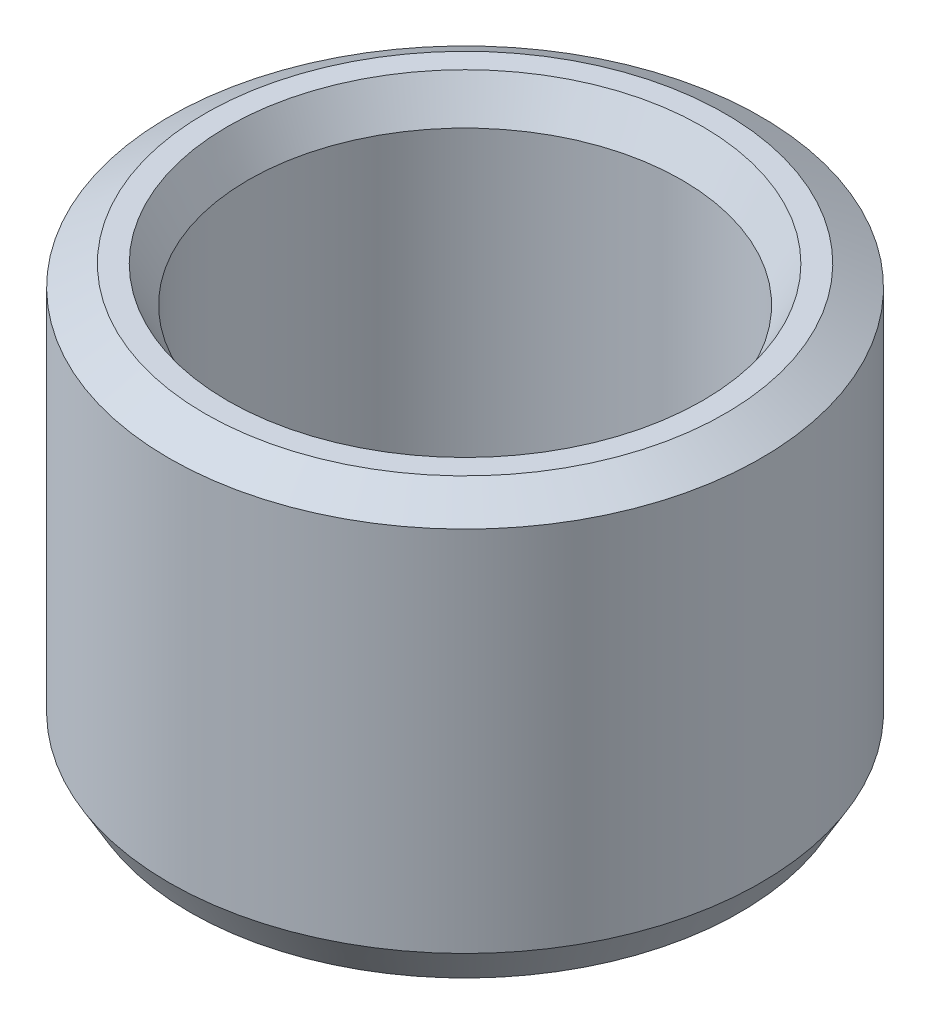
ISO-10303-21;
HEADER;
FILE_DESCRIPTION(('STEP AP214'),'2;1');
FILE_NAME('part.step','',(''),(''),'','','');
FILE_SCHEMA(('AUTOMOTIVE_DESIGN { 1 0 10303 214 1 1 1 1 }'));
ENDSEC;
DATA;
#1=APPLICATION_CONTEXT('core data for automotive mechanical design processes');
#2=APPLICATION_PROTOCOL_DEFINITION('international standard','automotive_design',2000,#1);
#3=PRODUCT_CONTEXT('',#1,'mechanical');
#4=PRODUCT('Part','Part','',(#3));
#5=PRODUCT_RELATED_PRODUCT_CATEGORY('part','',(#4));
#6=PRODUCT_DEFINITION_FORMATION('','',#4);
#7=PRODUCT_DEFINITION_CONTEXT('part definition',#1,'design');
#8=PRODUCT_DEFINITION('design','',#6,#7);
#9=PRODUCT_DEFINITION_SHAPE('','',#8);
#10=(LENGTH_UNIT() NAMED_UNIT(*) SI_UNIT(.MILLI.,.METRE.));
#11=(NAMED_UNIT(*) PLANE_ANGLE_UNIT() SI_UNIT($,.RADIAN.));
#12=(NAMED_UNIT(*) SI_UNIT($,.STERADIAN.) SOLID_ANGLE_UNIT());
#13=UNCERTAINTY_MEASURE_WITH_UNIT(LENGTH_MEASURE(1.E-05),#10,'distance_accuracy_value','');
#14=(GEOMETRIC_REPRESENTATION_CONTEXT(3) GLOBAL_UNCERTAINTY_ASSIGNED_CONTEXT((#13)) GLOBAL_UNIT_ASSIGNED_CONTEXT((#10,
#11,#12)) REPRESENTATION_CONTEXT('',''));
#15=CARTESIAN_POINT('',(0.,0.,0.));
#16=DIRECTION('',(0.,0.,1.));
#17=DIRECTION('',(1.,0.,0.));
#18=AXIS2_PLACEMENT_3D('',#15,#16,#17);
#19=CARTESIAN_POINT('',(0.,75.2497005737909,0.));
#20=DIRECTION('',(0.,-1.,0.));
#21=DIRECTION('',(0.,0.,-1.));
#22=AXIS2_PLACEMENT_3D('',#19,#20,#21);
#23=CYLINDRICAL_SURFACE('',#22,52.5);
#24=CARTESIAN_POINT('',(0.,6.36752102118943,0.));
#25=DIRECTION('',(0.,1.,0.));
#26=DIRECTION('',(0.,0.,1.));
#27=AXIS2_PLACEMENT_3D('',#24,#25,#26);
#28=CIRCLE('',#27,52.5);
#29=CARTESIAN_POINT('',(0.,6.36752102118943,52.5));
#30=VERTEX_POINT('',#29);
#31=EDGE_CURVE('E10',#30,#30,#28,.T.);
#32=ORIENTED_EDGE('',*,*,#31,.T.);
#33=EDGE_LOOP('',(#32));
#34=FACE_BOUND('',#33,.T.);
#35=CARTESIAN_POINT('',(0.,71.5734105981366,0.));
#36=DIRECTION('',(0.,1.,0.));
#37=DIRECTION('',(0.,0.,1.));
#38=AXIS2_PLACEMENT_3D('',#35,#36,#37);
#39=CIRCLE('',#38,52.5);
#40=CARTESIAN_POINT('',(0.,71.5734105981366,52.5));
#41=VERTEX_POINT('',#40);
#42=EDGE_CURVE('E50',#41,#41,#39,.F.);
#43=ORIENTED_EDGE('',*,*,#42,.T.);
#44=EDGE_LOOP('',(#43));
#45=FACE_BOUND('',#44,.T.);
#46=ADVANCED_FACE('F39',(#34,#45),#23,.T.);
#47=CARTESIAN_POINT('',(0.,75.2497005737909,0.));
#48=DIRECTION('',(0.,1.,0.));
#49=DIRECTION('',(0.,0.,1.));
#50=AXIS2_PLACEMENT_3D('',#47,#48,#49);
#51=PLANE('',#50);
#52=CARTESIAN_POINT('',(0.,75.2497005737909,0.));
#53=DIRECTION('',(0.,1.,0.));
#54=DIRECTION('',(0.,0.,1.));
#55=AXIS2_PLACEMENT_3D('',#52,#53,#54);
#56=CIRCLE('',#55,42.1329165088619);
#57=CARTESIAN_POINT('',(0.,75.2497005737909,42.1329165088619));
#58=VERTEX_POINT('',#57);
#59=EDGE_CURVE('E58',#58,#58,#56,.F.);
#60=ORIENTED_EDGE('',*,*,#59,.T.);
#61=EDGE_LOOP('',(#60));
#62=FACE_BOUND('',#61,.T.);
#63=CARTESIAN_POINT('',(0.,75.2497005737909,0.));
#64=DIRECTION('',(0.,1.,0.));
#65=DIRECTION('',(0.,0.,1.));
#66=AXIS2_PLACEMENT_3D('',#63,#64,#65);
#67=CIRCLE('',#66,46.1324789788106);
#68=CARTESIAN_POINT('',(0.,75.2497005737909,46.1324789788106));
#69=VERTEX_POINT('',#68);
#70=EDGE_CURVE('E61',#69,#69,#67,.T.);
#71=ORIENTED_EDGE('',*,*,#70,.T.);
#72=EDGE_LOOP('',(#71));
#73=FACE_BOUND('',#72,.T.);
#74=ADVANCED_FACE('F88',(#62,#73),#51,.T.);
#75=CARTESIAN_POINT('',(0.,0.,0.));
#76=DIRECTION('',(0.,1.,0.));
#77=DIRECTION('',(0.,0.,1.));
#78=AXIS2_PLACEMENT_3D('',#75,#76,#77);
#79=PLANE('',#78);
#80=CARTESIAN_POINT('',(0.,0.,0.));
#81=DIRECTION('',(0.,1.,0.));
#82=DIRECTION('',(0.,0.,1.));
#83=AXIS2_PLACEMENT_3D('',#80,#81,#82);
#84=CIRCLE('',#83,44.824147554397);
#85=CARTESIAN_POINT('',(0.,0.,44.824147554397));
#86=VERTEX_POINT('',#85);
#87=EDGE_CURVE('E51',#86,#86,#84,.T.);
#88=ORIENTED_EDGE('',*,*,#87,.T.);
#89=EDGE_LOOP('',(#88));
#90=FACE_BOUND('',#89,.T.);
#91=CARTESIAN_POINT('',(0.,0.,0.));
#92=DIRECTION('',(0.,1.,0.));
#93=DIRECTION('',(0.,0.,1.));
#94=AXIS2_PLACEMENT_3D('',#91,#92,#93);
#95=CIRCLE('',#94,48.8237100243457);
#96=CARTESIAN_POINT('',(0.,0.,48.8237100243457));
#97=VERTEX_POINT('',#96);
#98=EDGE_CURVE('E54',#97,#97,#95,.F.);
#99=ORIENTED_EDGE('',*,*,#98,.T.);
#100=EDGE_LOOP('',(#99));
#101=FACE_BOUND('',#100,.T.);
#102=ADVANCED_FACE('F83',(#90,#101),#79,.F.);
#103=CARTESIAN_POINT('',(0.,75.2497005737909,0.));
#104=DIRECTION('',(0.,-1.,0.));
#105=DIRECTION('',(0.,0.,-1.));
#106=AXIS2_PLACEMENT_3D('',#103,#104,#105);
#107=CYLINDRICAL_SURFACE('',#106,38.4566265332076);
#108=CARTESIAN_POINT('',(0.,68.8821795526015,0.));
#109=DIRECTION('',(0.,1.,0.));
#110=DIRECTION('',(0.,0.,1.));
#111=AXIS2_PLACEMENT_3D('',#108,#109,#110);
#112=CIRCLE('',#111,38.4566265332076);
#113=CARTESIAN_POINT('',(0.,68.8821795526015,38.4566265332076));
#114=VERTEX_POINT('',#113);
#115=EDGE_CURVE('E67',#114,#114,#112,.T.);
#116=ORIENTED_EDGE('',*,*,#115,.T.);
#117=EDGE_LOOP('',(#116));
#118=FACE_BOUND('',#117,.T.);
#119=CARTESIAN_POINT('',(0.,3.67628997565435,0.));
#120=DIRECTION('',(0.,1.,0.));
#121=DIRECTION('',(0.,0.,1.));
#122=AXIS2_PLACEMENT_3D('',#119,#120,#121);
#123=CIRCLE('',#122,38.4566265332076);
#124=CARTESIAN_POINT('',(0.,3.67628997565435,38.4566265332076));
#125=VERTEX_POINT('',#124);
#126=EDGE_CURVE('E69',#125,#125,#123,.F.);
#127=ORIENTED_EDGE('',*,*,#126,.T.);
#128=EDGE_LOOP('',(#127));
#129=FACE_BOUND('',#128,.T.);
#130=ADVANCED_FACE('F71',(#118,#129),#107,.F.);
#131=CARTESIAN_POINT('',(0.,68.8821795526015,0.));
#132=DIRECTION('',(0.,1.,0.));
#133=DIRECTION('',(0.,0.,1.));
#134=AXIS2_PLACEMENT_3D('',#131,#132,#133);
#135=CONICAL_SURFACE('',#134,38.4566265332076,0.523598775598303);
#136=ORIENTED_EDGE('',*,*,#59,.F.);
#137=EDGE_LOOP('',(#136));
#138=FACE_BOUND('',#137,.T.);
#139=ORIENTED_EDGE('',*,*,#115,.F.);
#140=EDGE_LOOP('',(#139));
#141=FACE_BOUND('',#140,.T.);
#142=ADVANCED_FACE('F77',(#138,#141),#135,.F.);
#143=CARTESIAN_POINT('',(0.,0.,0.));
#144=DIRECTION('',(0.,-1.,0.));
#145=DIRECTION('',(0.,0.,-1.));
#146=AXIS2_PLACEMENT_3D('',#143,#144,#145);
#147=CONICAL_SURFACE('',#146,44.824147554397,1.04719755119659);
#148=ORIENTED_EDGE('',*,*,#126,.F.);
#149=EDGE_LOOP('',(#148));
#150=FACE_BOUND('',#149,.T.);
#151=ORIENTED_EDGE('',*,*,#87,.F.);
#152=EDGE_LOOP('',(#151));
#153=FACE_BOUND('',#152,.T.);
#154=ADVANCED_FACE('F73',(#150,#153),#147,.F.);
#155=CARTESIAN_POINT('',(0.,6.36752102118943,0.));
#156=DIRECTION('',(0.,1.,0.));
#157=DIRECTION('',(0.,0.,1.));
#158=AXIS2_PLACEMENT_3D('',#155,#156,#157);
#159=CONICAL_SURFACE('',#158,52.5,0.523598775598303);
#160=ORIENTED_EDGE('',*,*,#98,.F.);
#161=EDGE_LOOP('',(#160));
#162=FACE_BOUND('',#161,.T.);
#163=ORIENTED_EDGE('',*,*,#31,.F.);
#164=EDGE_LOOP('',(#163));
#165=FACE_BOUND('',#164,.T.);
#166=ADVANCED_FACE('F76',(#162,#165),#159,.T.);
#167=CARTESIAN_POINT('',(0.,75.2497005737909,0.));
#168=DIRECTION('',(0.,-1.,0.));
#169=DIRECTION('',(0.,0.,-1.));
#170=AXIS2_PLACEMENT_3D('',#167,#168,#169);
#171=CONICAL_SURFACE('',#170,46.1324789788106,1.04719755119659);
#172=ORIENTED_EDGE('',*,*,#42,.F.);
#173=EDGE_LOOP('',(#172));
#174=FACE_BOUND('',#173,.T.);
#175=ORIENTED_EDGE('',*,*,#70,.F.);
#176=EDGE_LOOP('',(#175));
#177=FACE_BOUND('',#176,.T.);
#178=ADVANCED_FACE('F45',(#174,#177),#171,.T.);
#179=CLOSED_SHELL('',(#46,#74,#102,#130,#142,#154,#166,#178));
#180=MANIFOLD_SOLID_BREP('B2',#179);
#181=ADVANCED_BREP_SHAPE_REPRESENTATION('',(#18,#180),#14);
#182=SHAPE_DEFINITION_REPRESENTATION(#9,#181);
ENDSEC;
END-ISO-10303-21;
